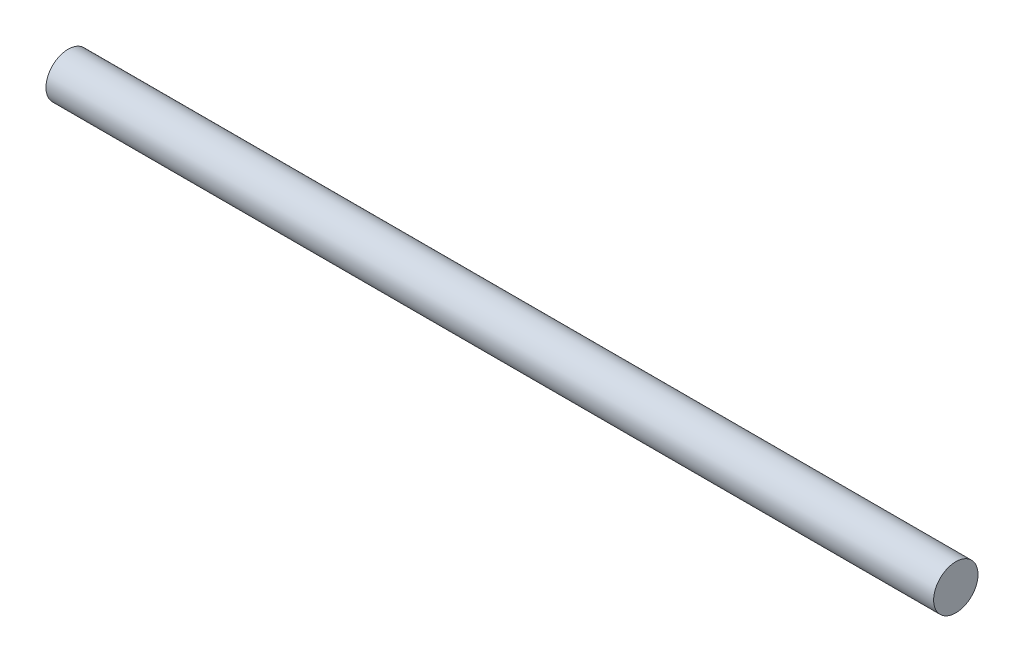
ISO-10303-21;
HEADER;
FILE_DESCRIPTION(('STEP AP214'),'2;1');
FILE_NAME('part.step','',(''),(''),'','','');
FILE_SCHEMA(('AUTOMOTIVE_DESIGN { 1 0 10303 214 1 1 1 1 }'));
ENDSEC;
DATA;
#1=APPLICATION_CONTEXT('core data for automotive mechanical design processes');
#2=APPLICATION_PROTOCOL_DEFINITION('international standard','automotive_design',2000,#1);
#3=PRODUCT_CONTEXT('',#1,'mechanical');
#4=PRODUCT('Part','Part','',(#3));
#5=PRODUCT_RELATED_PRODUCT_CATEGORY('part','',(#4));
#6=PRODUCT_DEFINITION_FORMATION('','',#4);
#7=PRODUCT_DEFINITION_CONTEXT('part definition',#1,'design');
#8=PRODUCT_DEFINITION('design','',#6,#7);
#9=PRODUCT_DEFINITION_SHAPE('','',#8);
#10=(LENGTH_UNIT() NAMED_UNIT(*) SI_UNIT(.MILLI.,.METRE.));
#11=(NAMED_UNIT(*) PLANE_ANGLE_UNIT() SI_UNIT($,.RADIAN.));
#12=(NAMED_UNIT(*) SI_UNIT($,.STERADIAN.) SOLID_ANGLE_UNIT());
#13=UNCERTAINTY_MEASURE_WITH_UNIT(LENGTH_MEASURE(1.E-05),#10,'distance_accuracy_value','');
#14=(GEOMETRIC_REPRESENTATION_CONTEXT(3) GLOBAL_UNCERTAINTY_ASSIGNED_CONTEXT((#13)) GLOBAL_UNIT_ASSIGNED_CONTEXT((#10,
#11,#12)) REPRESENTATION_CONTEXT('',''));
#15=CARTESIAN_POINT('',(0.,0.,0.));
#16=DIRECTION('',(0.,0.,1.));
#17=DIRECTION('',(1.,0.,0.));
#18=AXIS2_PLACEMENT_3D('',#15,#16,#17);
#19=CARTESIAN_POINT('',(20.,0.,0.));
#20=DIRECTION('',(-1.,0.,0.));
#21=DIRECTION('',(0.,0.,1.));
#22=AXIS2_PLACEMENT_3D('',#19,#20,#21);
#23=CYLINDRICAL_SURFACE('',#22,1.);
#24=CARTESIAN_POINT('',(20.,0.,0.));
#25=DIRECTION('',(1.,0.,0.));
#26=DIRECTION('',(0.,0.,-1.));
#27=AXIS2_PLACEMENT_3D('',#24,#25,#26);
#28=CIRCLE('',#27,1.);
#29=CARTESIAN_POINT('',(20.,0.,-1.));
#30=VERTEX_POINT('',#29);
#31=EDGE_CURVE('E11',#30,#30,#28,.T.);
#32=ORIENTED_EDGE('',*,*,#31,.F.);
#33=EDGE_LOOP('',(#32));
#34=FACE_BOUND('',#33,.T.);
#35=CARTESIAN_POINT('',(-20.,0.,0.));
#36=DIRECTION('',(1.,0.,0.));
#37=DIRECTION('',(0.,0.,-1.));
#38=AXIS2_PLACEMENT_3D('',#35,#36,#37);
#39=CIRCLE('',#38,1.);
#40=CARTESIAN_POINT('',(-20.,0.,-1.));
#41=VERTEX_POINT('',#40);
#42=EDGE_CURVE('E39',#41,#41,#39,.T.);
#43=ORIENTED_EDGE('',*,*,#42,.T.);
#44=EDGE_LOOP('',(#43));
#45=FACE_BOUND('',#44,.T.);
#46=ADVANCED_FACE('F36',(#34,#45),#23,.T.);
#47=CARTESIAN_POINT('',(20.,0.,0.));
#48=DIRECTION('',(1.,0.,0.));
#49=DIRECTION('',(0.,0.,-1.));
#50=AXIS2_PLACEMENT_3D('',#47,#48,#49);
#51=PLANE('',#50);
#52=ORIENTED_EDGE('',*,*,#31,.T.);
#53=EDGE_LOOP('',(#52));
#54=FACE_BOUND('',#53,.T.);
#55=ADVANCED_FACE('F55',(#54),#51,.T.);
#56=CARTESIAN_POINT('',(-20.,0.,0.));
#57=DIRECTION('',(1.,0.,0.));
#58=DIRECTION('',(0.,0.,-1.));
#59=AXIS2_PLACEMENT_3D('',#56,#57,#58);
#60=PLANE('',#59);
#61=ORIENTED_EDGE('',*,*,#42,.F.);
#62=EDGE_LOOP('',(#61));
#63=FACE_BOUND('',#62,.T.);
#64=ADVANCED_FACE('F53',(#63),#60,.F.);
#65=CLOSED_SHELL('',(#46,#55,#64));
#66=MANIFOLD_SOLID_BREP('B2',#65);
#67=ADVANCED_BREP_SHAPE_REPRESENTATION('',(#18,#66),#14);
#68=SHAPE_DEFINITION_REPRESENTATION(#9,#67);
ENDSEC;
END-ISO-10303-21;
